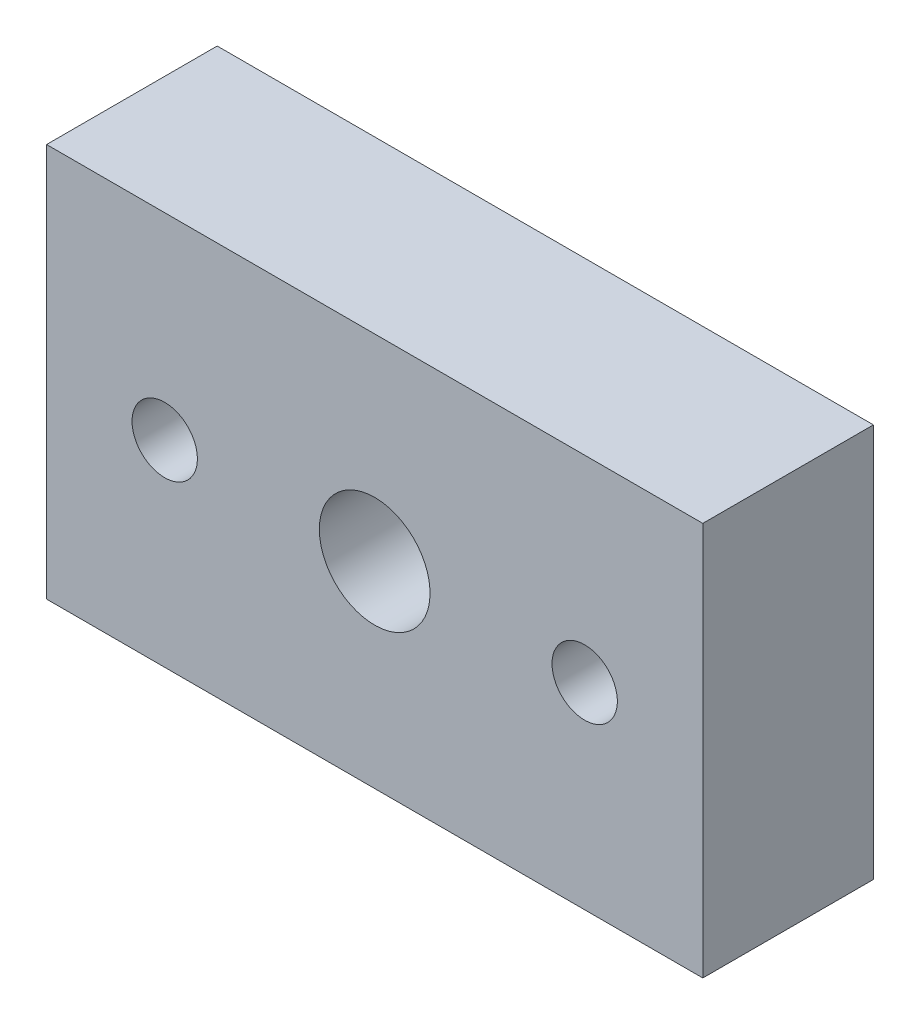
ISO-10303-21;
HEADER;
FILE_DESCRIPTION(('STEP AP214'),'2;1');
FILE_NAME('part.step','',(''),(''),'','','');
FILE_SCHEMA(('AUTOMOTIVE_DESIGN { 1 0 10303 214 1 1 1 1 }'));
ENDSEC;
DATA;
#1=APPLICATION_CONTEXT('core data for automotive mechanical design processes');
#2=APPLICATION_PROTOCOL_DEFINITION('international standard','automotive_design',2000,#1);
#3=PRODUCT_CONTEXT('',#1,'mechanical');
#4=PRODUCT('Part','Part','',(#3));
#5=PRODUCT_RELATED_PRODUCT_CATEGORY('part','',(#4));
#6=PRODUCT_DEFINITION_FORMATION('','',#4);
#7=PRODUCT_DEFINITION_CONTEXT('part definition',#1,'design');
#8=PRODUCT_DEFINITION('design','',#6,#7);
#9=PRODUCT_DEFINITION_SHAPE('','',#8);
#10=(LENGTH_UNIT() NAMED_UNIT(*) SI_UNIT(.MILLI.,.METRE.));
#11=(NAMED_UNIT(*) PLANE_ANGLE_UNIT() SI_UNIT($,.RADIAN.));
#12=(NAMED_UNIT(*) SI_UNIT($,.STERADIAN.) SOLID_ANGLE_UNIT());
#13=UNCERTAINTY_MEASURE_WITH_UNIT(LENGTH_MEASURE(1.E-05),#10,'distance_accuracy_value','');
#14=(GEOMETRIC_REPRESENTATION_CONTEXT(3) GLOBAL_UNCERTAINTY_ASSIGNED_CONTEXT((#13)) GLOBAL_UNIT_ASSIGNED_CONTEXT((#10,
#11,#12)) REPRESENTATION_CONTEXT('',''));
#15=CARTESIAN_POINT('',(0.,0.,0.));
#16=DIRECTION('',(0.,0.,1.));
#17=DIRECTION('',(1.,0.,0.));
#18=AXIS2_PLACEMENT_3D('',#15,#16,#17);
#19=CARTESIAN_POINT('',(25.,-15.,13.));
#20=DIRECTION('',(-1.,0.,0.));
#21=DIRECTION('',(0.,0.,1.));
#22=AXIS2_PLACEMENT_3D('',#19,#20,#21);
#23=PLANE('',#22);
#24=DIRECTION('',(0.,1.,0.));
#25=VECTOR('',#24,1.);
#26=CARTESIAN_POINT('',(25.,-15.,0.));
#27=LINE('',#26,#25);
#28=CARTESIAN_POINT('',(25.,-15.,0.));
#29=VERTEX_POINT('',#28);
#30=CARTESIAN_POINT('',(25.,15.,0.));
#31=VERTEX_POINT('',#30);
#32=EDGE_CURVE('E97',#29,#31,#27,.T.);
#33=ORIENTED_EDGE('',*,*,#32,.T.);
#34=DIRECTION('',(0.,0.,-1.));
#35=VECTOR('',#34,1.);
#36=CARTESIAN_POINT('',(25.,15.,13.));
#37=LINE('',#36,#35);
#38=CARTESIAN_POINT('',(25.,15.,13.));
#39=VERTEX_POINT('',#38);
#40=EDGE_CURVE('E11',#39,#31,#37,.T.);
#41=ORIENTED_EDGE('',*,*,#40,.F.);
#42=DIRECTION('',(0.,1.,0.));
#43=VECTOR('',#42,1.);
#44=CARTESIAN_POINT('',(25.,-15.,13.));
#45=LINE('',#44,#43);
#46=CARTESIAN_POINT('',(25.,-15.,13.));
#47=VERTEX_POINT('',#46);
#48=EDGE_CURVE('E85',#47,#39,#45,.T.);
#49=ORIENTED_EDGE('',*,*,#48,.F.);
#50=DIRECTION('',(0.,0.,-1.));
#51=VECTOR('',#50,1.);
#52=CARTESIAN_POINT('',(25.,-15.,13.));
#53=LINE('',#52,#51);
#54=EDGE_CURVE('E93',#47,#29,#53,.T.);
#55=ORIENTED_EDGE('',*,*,#54,.T.);
#56=EDGE_LOOP('',(#33,#41,#49,#55));
#57=FACE_BOUND('',#56,.T.);
#58=ADVANCED_FACE('F34',(#57),#23,.F.);
#59=CARTESIAN_POINT('',(-25.,15.,13.));
#60=DIRECTION('',(0.,-1.,0.));
#61=DIRECTION('',(0.,0.,-1.));
#62=AXIS2_PLACEMENT_3D('',#59,#60,#61);
#63=PLANE('',#62);
#64=DIRECTION('',(-1.,0.,0.));
#65=VECTOR('',#64,1.);
#66=CARTESIAN_POINT('',(-25.,15.,0.));
#67=LINE('',#66,#65);
#68=CARTESIAN_POINT('',(-25.,15.,0.));
#69=VERTEX_POINT('',#68);
#70=EDGE_CURVE('E89',#31,#69,#67,.T.);
#71=ORIENTED_EDGE('',*,*,#70,.T.);
#72=DIRECTION('',(0.,0.,-1.));
#73=VECTOR('',#72,1.);
#74=CARTESIAN_POINT('',(-25.,15.,13.));
#75=LINE('',#74,#73);
#76=CARTESIAN_POINT('',(-25.,15.,13.));
#77=VERTEX_POINT('',#76);
#78=EDGE_CURVE('E42',#77,#69,#75,.T.);
#79=ORIENTED_EDGE('',*,*,#78,.F.);
#80=DIRECTION('',(-1.,0.,0.));
#81=VECTOR('',#80,1.);
#82=CARTESIAN_POINT('',(-25.,15.,13.));
#83=LINE('',#82,#81);
#84=EDGE_CURVE('E80',#39,#77,#83,.T.);
#85=ORIENTED_EDGE('',*,*,#84,.F.);
#86=ORIENTED_EDGE('',*,*,#40,.T.);
#87=EDGE_LOOP('',(#71,#79,#85,#86));
#88=FACE_BOUND('',#87,.T.);
#89=ADVANCED_FACE('F88',(#88),#63,.F.);
#90=CARTESIAN_POINT('',(-25.,-15.,13.));
#91=DIRECTION('',(1.,0.,0.));
#92=DIRECTION('',(0.,0.,-1.));
#93=AXIS2_PLACEMENT_3D('',#90,#91,#92);
#94=PLANE('',#93);
#95=DIRECTION('',(0.,-1.,0.));
#96=VECTOR('',#95,1.);
#97=CARTESIAN_POINT('',(-25.,-15.,0.));
#98=LINE('',#97,#96);
#99=CARTESIAN_POINT('',(-25.,-15.,0.));
#100=VERTEX_POINT('',#99);
#101=EDGE_CURVE('E67',#69,#100,#98,.T.);
#102=ORIENTED_EDGE('',*,*,#101,.T.);
#103=DIRECTION('',(0.,0.,-1.));
#104=VECTOR('',#103,1.);
#105=CARTESIAN_POINT('',(-25.,-15.,13.));
#106=LINE('',#105,#104);
#107=CARTESIAN_POINT('',(-25.,-15.,13.));
#108=VERTEX_POINT('',#107);
#109=EDGE_CURVE('E90',#108,#100,#106,.T.);
#110=ORIENTED_EDGE('',*,*,#109,.F.);
#111=DIRECTION('',(0.,-1.,0.));
#112=VECTOR('',#111,1.);
#113=CARTESIAN_POINT('',(-25.,-15.,13.));
#114=LINE('',#113,#112);
#115=EDGE_CURVE('E83',#77,#108,#114,.T.);
#116=ORIENTED_EDGE('',*,*,#115,.F.);
#117=ORIENTED_EDGE('',*,*,#78,.T.);
#118=EDGE_LOOP('',(#102,#110,#116,#117));
#119=FACE_BOUND('',#118,.T.);
#120=ADVANCED_FACE('F91',(#119),#94,.F.);
#121=CARTESIAN_POINT('',(-25.,-15.,13.));
#122=DIRECTION('',(0.,1.,0.));
#123=DIRECTION('',(0.,0.,1.));
#124=AXIS2_PLACEMENT_3D('',#121,#122,#123);
#125=PLANE('',#124);
#126=DIRECTION('',(1.,0.,0.));
#127=VECTOR('',#126,1.);
#128=CARTESIAN_POINT('',(-25.,-15.,0.));
#129=LINE('',#128,#127);
#130=EDGE_CURVE('E73',#100,#29,#129,.T.);
#131=ORIENTED_EDGE('',*,*,#130,.T.);
#132=ORIENTED_EDGE('',*,*,#54,.F.);
#133=DIRECTION('',(1.,0.,0.));
#134=VECTOR('',#133,1.);
#135=CARTESIAN_POINT('',(-25.,-15.,13.));
#136=LINE('',#135,#134);
#137=EDGE_CURVE('E50',#108,#47,#136,.T.);
#138=ORIENTED_EDGE('',*,*,#137,.F.);
#139=ORIENTED_EDGE('',*,*,#109,.T.);
#140=EDGE_LOOP('',(#131,#132,#138,#139));
#141=FACE_BOUND('',#140,.T.);
#142=ADVANCED_FACE('F105',(#141),#125,.F.);
#143=CARTESIAN_POINT('',(0.,0.,13.));
#144=DIRECTION('',(0.,0.,-1.));
#145=DIRECTION('',(-1.,0.,0.));
#146=AXIS2_PLACEMENT_3D('',#143,#144,#145);
#147=PLANE('',#146);
#148=CARTESIAN_POINT('',(16.,0.,13.));
#149=DIRECTION('',(0.,0.,-1.));
#150=DIRECTION('',(-1.,0.,0.));
#151=AXIS2_PLACEMENT_3D('',#148,#149,#150);
#152=CIRCLE('',#151,2.48919999999998);
#153=CARTESIAN_POINT('',(13.5108,0.,13.));
#154=VERTEX_POINT('',#153);
#155=EDGE_CURVE('E122',#154,#154,#152,.T.);
#156=ORIENTED_EDGE('',*,*,#155,.T.);
#157=EDGE_LOOP('',(#156));
#158=FACE_BOUND('',#157,.T.);
#159=CARTESIAN_POINT('',(-16.,0.,13.));
#160=DIRECTION('',(0.,0.,-1.));
#161=DIRECTION('',(-1.,0.,0.));
#162=AXIS2_PLACEMENT_3D('',#159,#160,#161);
#163=CIRCLE('',#162,2.48919999999998);
#164=CARTESIAN_POINT('',(-18.4892,0.,13.));
#165=VERTEX_POINT('',#164);
#166=EDGE_CURVE('E116',#165,#165,#163,.T.);
#167=ORIENTED_EDGE('',*,*,#166,.T.);
#168=EDGE_LOOP('',(#167));
#169=FACE_BOUND('',#168,.T.);
#170=CARTESIAN_POINT('',(0.,0.,13.));
#171=DIRECTION('',(0.,0.,-1.));
#172=DIRECTION('',(-1.,0.,0.));
#173=AXIS2_PLACEMENT_3D('',#170,#171,#172);
#174=CIRCLE('',#173,4.21639999999998);
#175=CARTESIAN_POINT('',(-4.21639999999998,0.,13.));
#176=VERTEX_POINT('',#175);
#177=EDGE_CURVE('E100',#176,#176,#174,.T.);
#178=ORIENTED_EDGE('',*,*,#177,.T.);
#179=EDGE_LOOP('',(#178));
#180=FACE_BOUND('',#179,.T.);
#181=ORIENTED_EDGE('',*,*,#48,.T.);
#182=ORIENTED_EDGE('',*,*,#84,.T.);
#183=ORIENTED_EDGE('',*,*,#115,.T.);
#184=ORIENTED_EDGE('',*,*,#137,.T.);
#185=EDGE_LOOP('',(#181,#182,#183,#184));
#186=FACE_BOUND('',#185,.T.);
#187=ADVANCED_FACE('F81',(#158,#169,#180,#186),#147,.F.);
#188=CARTESIAN_POINT('',(0.,0.,0.));
#189=DIRECTION('',(0.,0.,-1.));
#190=DIRECTION('',(-1.,0.,0.));
#191=AXIS2_PLACEMENT_3D('',#188,#189,#190);
#192=PLANE('',#191);
#193=CARTESIAN_POINT('',(16.,0.,0.));
#194=DIRECTION('',(0.,0.,-1.));
#195=DIRECTION('',(-1.,0.,0.));
#196=AXIS2_PLACEMENT_3D('',#193,#194,#195);
#197=CIRCLE('',#196,2.48919999999998);
#198=CARTESIAN_POINT('',(13.5108,0.,0.));
#199=VERTEX_POINT('',#198);
#200=EDGE_CURVE('E125',#199,#199,#197,.T.);
#201=ORIENTED_EDGE('',*,*,#200,.F.);
#202=EDGE_LOOP('',(#201));
#203=FACE_BOUND('',#202,.T.);
#204=CARTESIAN_POINT('',(-16.,0.,0.));
#205=DIRECTION('',(0.,0.,-1.));
#206=DIRECTION('',(-1.,0.,0.));
#207=AXIS2_PLACEMENT_3D('',#204,#205,#206);
#208=CIRCLE('',#207,2.48919999999998);
#209=CARTESIAN_POINT('',(-18.4892,0.,0.));
#210=VERTEX_POINT('',#209);
#211=EDGE_CURVE('E119',#210,#210,#208,.T.);
#212=ORIENTED_EDGE('',*,*,#211,.F.);
#213=EDGE_LOOP('',(#212));
#214=FACE_BOUND('',#213,.T.);
#215=CARTESIAN_POINT('',(0.,0.,0.));
#216=DIRECTION('',(0.,0.,-1.));
#217=DIRECTION('',(-1.,0.,0.));
#218=AXIS2_PLACEMENT_3D('',#215,#216,#217);
#219=CIRCLE('',#218,4.21639999999999);
#220=CARTESIAN_POINT('',(-4.21639999999999,0.,0.));
#221=VERTEX_POINT('',#220);
#222=EDGE_CURVE('E113',#221,#221,#219,.T.);
#223=ORIENTED_EDGE('',*,*,#222,.F.);
#224=EDGE_LOOP('',(#223));
#225=FACE_BOUND('',#224,.T.);
#226=ORIENTED_EDGE('',*,*,#32,.F.);
#227=ORIENTED_EDGE('',*,*,#130,.F.);
#228=ORIENTED_EDGE('',*,*,#101,.F.);
#229=ORIENTED_EDGE('',*,*,#70,.F.);
#230=EDGE_LOOP('',(#226,#227,#228,#229));
#231=FACE_BOUND('',#230,.T.);
#232=ADVANCED_FACE('F108',(#203,#214,#225,#231),#192,.T.);
#233=CARTESIAN_POINT('',(0.,0.,0.));
#234=DIRECTION('',(0.,0.,-1.));
#235=DIRECTION('',(-1.,0.,0.));
#236=AXIS2_PLACEMENT_3D('',#233,#234,#235);
#237=CYLINDRICAL_SURFACE('',#236,4.21639999999998);
#238=ORIENTED_EDGE('',*,*,#222,.T.);
#239=EDGE_LOOP('',(#238));
#240=FACE_BOUND('',#239,.T.);
#241=ORIENTED_EDGE('',*,*,#177,.F.);
#242=EDGE_LOOP('',(#241));
#243=FACE_BOUND('',#242,.T.);
#244=ADVANCED_FACE('F134',(#240,#243),#237,.F.);
#245=CARTESIAN_POINT('',(-16.,0.,0.));
#246=DIRECTION('',(0.,0.,-1.));
#247=DIRECTION('',(-1.,0.,0.));
#248=AXIS2_PLACEMENT_3D('',#245,#246,#247);
#249=CYLINDRICAL_SURFACE('',#248,2.48919999999998);
#250=ORIENTED_EDGE('',*,*,#211,.T.);
#251=EDGE_LOOP('',(#250));
#252=FACE_BOUND('',#251,.T.);
#253=ORIENTED_EDGE('',*,*,#166,.F.);
#254=EDGE_LOOP('',(#253));
#255=FACE_BOUND('',#254,.T.);
#256=ADVANCED_FACE('F142',(#252,#255),#249,.F.);
#257=CARTESIAN_POINT('',(16.,0.,0.));
#258=DIRECTION('',(0.,0.,-1.));
#259=DIRECTION('',(-1.,0.,0.));
#260=AXIS2_PLACEMENT_3D('',#257,#258,#259);
#261=CYLINDRICAL_SURFACE('',#260,2.48919999999998);
#262=ORIENTED_EDGE('',*,*,#200,.T.);
#263=EDGE_LOOP('',(#262));
#264=FACE_BOUND('',#263,.T.);
#265=ORIENTED_EDGE('',*,*,#155,.F.);
#266=EDGE_LOOP('',(#265));
#267=FACE_BOUND('',#266,.T.);
#268=ADVANCED_FACE('F129',(#264,#267),#261,.F.);
#269=CLOSED_SHELL('',(#58,#89,#120,#142,#187,#232,#244,#256,#268));
#270=MANIFOLD_SOLID_BREP('B2',#269);
#271=ADVANCED_BREP_SHAPE_REPRESENTATION('',(#18,#270),#14);
#272=SHAPE_DEFINITION_REPRESENTATION(#9,#271);
ENDSEC;
END-ISO-10303-21;
